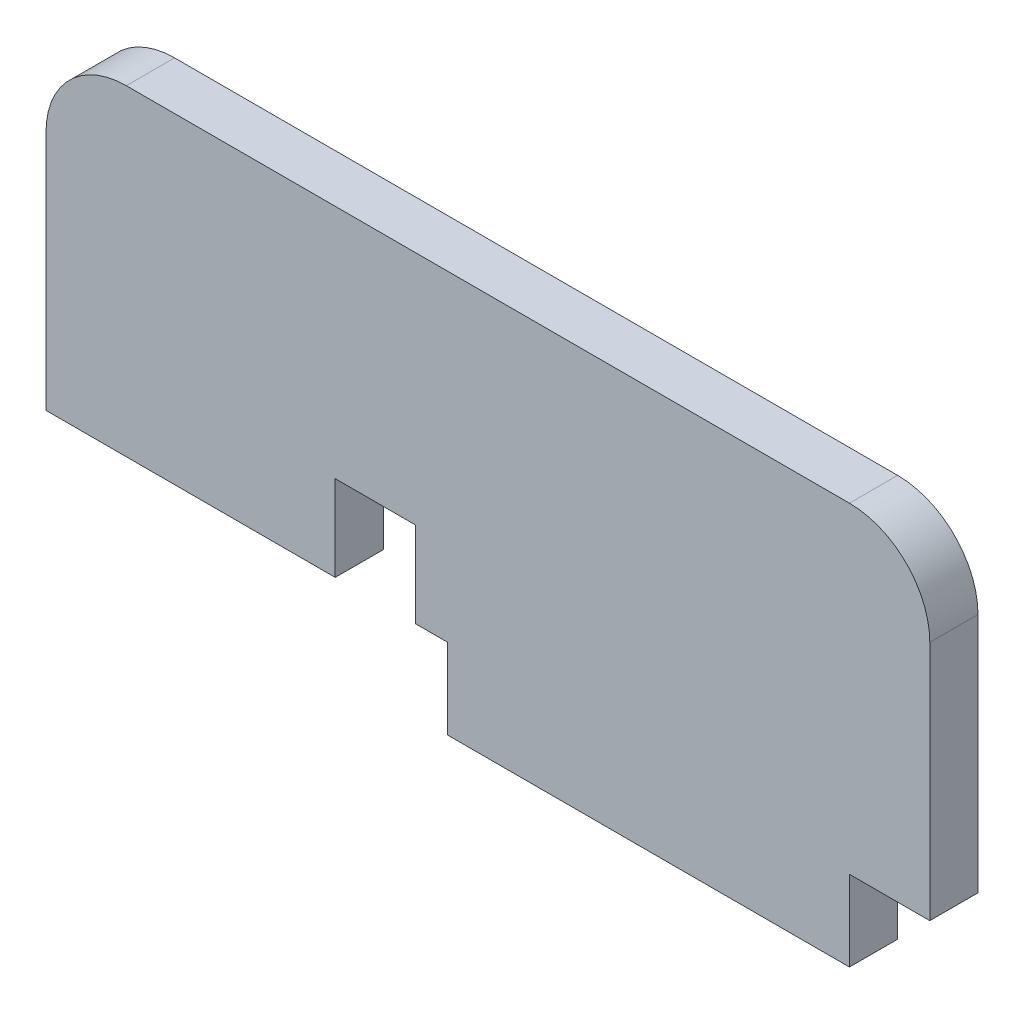
ISO-10303-21;
HEADER;
FILE_DESCRIPTION(('STEP AP214'),'2;1');
FILE_NAME('part.step','',(''),(''),'','','');
FILE_SCHEMA(('AUTOMOTIVE_DESIGN { 1 0 10303 214 1 1 1 1 }'));
ENDSEC;
DATA;
#1=APPLICATION_CONTEXT('core data for automotive mechanical design processes');
#2=APPLICATION_PROTOCOL_DEFINITION('international standard','automotive_design',2000,#1);
#3=PRODUCT_CONTEXT('',#1,'mechanical');
#4=PRODUCT('Part','Part','',(#3));
#5=PRODUCT_RELATED_PRODUCT_CATEGORY('part','',(#4));
#6=PRODUCT_DEFINITION_FORMATION('','',#4);
#7=PRODUCT_DEFINITION_CONTEXT('part definition',#1,'design');
#8=PRODUCT_DEFINITION('design','',#6,#7);
#9=PRODUCT_DEFINITION_SHAPE('','',#8);
#10=(LENGTH_UNIT() NAMED_UNIT(*) SI_UNIT(.MILLI.,.METRE.));
#11=(NAMED_UNIT(*) PLANE_ANGLE_UNIT() SI_UNIT($,.RADIAN.));
#12=(NAMED_UNIT(*) SI_UNIT($,.STERADIAN.) SOLID_ANGLE_UNIT());
#13=UNCERTAINTY_MEASURE_WITH_UNIT(LENGTH_MEASURE(1.E-05),#10,'distance_accuracy_value','');
#14=(GEOMETRIC_REPRESENTATION_CONTEXT(3) GLOBAL_UNCERTAINTY_ASSIGNED_CONTEXT((#13)) GLOBAL_UNIT_ASSIGNED_CONTEXT((#10,
#11,#12)) REPRESENTATION_CONTEXT('',''));
#15=CARTESIAN_POINT('',(0.,0.,0.));
#16=DIRECTION('',(0.,0.,1.));
#17=DIRECTION('',(1.,0.,0.));
#18=AXIS2_PLACEMENT_3D('',#15,#16,#17);
#19=CARTESIAN_POINT('',(-57.9411801297946,1.36975681721755,3.));
#20=DIRECTION('',(0.,1.,0.));
#21=DIRECTION('',(0.,0.,1.));
#22=AXIS2_PLACEMENT_3D('',#19,#20,#21);
#23=PLANE('',#22);
#24=DIRECTION('',(1.,0.,0.));
#25=VECTOR('',#24,1.);
#26=CARTESIAN_POINT('',(-57.9411801297946,1.36975681721755,0.));
#27=LINE('',#26,#25);
#28=CARTESIAN_POINT('',(-57.9411801297946,1.36975681721755,0.));
#29=VERTEX_POINT('',#28);
#30=CARTESIAN_POINT('',(-39.9411801297946,1.36975681721755,0.));
#31=VERTEX_POINT('',#30);
#32=EDGE_CURVE('E168',#29,#31,#27,.T.);
#33=ORIENTED_EDGE('',*,*,#32,.T.);
#34=DIRECTION('',(0.,0.,1.));
#35=VECTOR('',#34,1.);
#36=CARTESIAN_POINT('',(-39.9411801297946,1.36975681721755,0.));
#37=LINE('',#36,#35);
#38=CARTESIAN_POINT('',(-39.9411801297946,1.36975681721755,3.));
#39=VERTEX_POINT('',#38);
#40=EDGE_CURVE('E232',#31,#39,#37,.T.);
#41=ORIENTED_EDGE('',*,*,#40,.T.);
#42=DIRECTION('',(1.,0.,0.));
#43=VECTOR('',#42,1.);
#44=CARTESIAN_POINT('',(-57.9411801297946,1.36975681721755,3.));
#45=LINE('',#44,#43);
#46=CARTESIAN_POINT('',(-57.9411801297946,1.36975681721755,3.));
#47=VERTEX_POINT('',#46);
#48=EDGE_CURVE('E219',#47,#39,#45,.T.);
#49=ORIENTED_EDGE('',*,*,#48,.F.);
#50=DIRECTION('',(0.,0.,-1.));
#51=VECTOR('',#50,1.);
#52=CARTESIAN_POINT('',(-57.9411801297946,1.36975681721755,3.));
#53=LINE('',#52,#51);
#54=EDGE_CURVE('E184',#47,#29,#53,.T.);
#55=ORIENTED_EDGE('',*,*,#54,.T.);
#56=EDGE_LOOP('',(#33,#41,#49,#55));
#57=FACE_BOUND('',#56,.T.);
#58=ADVANCED_FACE('F33',(#57),#23,.F.);
#59=CARTESIAN_POINT('',(-2.94118012979462,16.3697568172175,3.));
#60=DIRECTION('',(-1.,0.,0.));
#61=DIRECTION('',(0.,-1.,0.));
#62=AXIS2_PLACEMENT_3D('',#59,#60,#61);
#63=PLANE('',#62);
#64=DIRECTION('',(0.,1.,0.));
#65=VECTOR('',#64,1.);
#66=CARTESIAN_POINT('',(-2.94118012979462,16.3697568172175,0.));
#67=LINE('',#66,#65);
#68=CARTESIAN_POINT('',(-2.94118012979462,1.36975681721755,0.));
#69=VERTEX_POINT('',#68);
#70=CARTESIAN_POINT('',(-2.94118012979461,16.3697568172175,0.));
#71=VERTEX_POINT('',#70);
#72=EDGE_CURVE('E155',#69,#71,#67,.T.);
#73=ORIENTED_EDGE('',*,*,#72,.T.);
#74=DIRECTION('',(0.,0.,-1.));
#75=VECTOR('',#74,1.);
#76=CARTESIAN_POINT('',(-2.94118012979461,16.3697568172175,3.));
#77=LINE('',#76,#75);
#78=CARTESIAN_POINT('',(-2.94118012979461,16.3697568172175,3.));
#79=VERTEX_POINT('',#78);
#80=EDGE_CURVE('E11',#79,#71,#77,.T.);
#81=ORIENTED_EDGE('',*,*,#80,.F.);
#82=DIRECTION('',(0.,1.,0.));
#83=VECTOR('',#82,1.);
#84=CARTESIAN_POINT('',(-2.94118012979462,16.3697568172175,3.));
#85=LINE('',#84,#83);
#86=CARTESIAN_POINT('',(-2.94118012979462,1.36975681721755,3.));
#87=VERTEX_POINT('',#86);
#88=EDGE_CURVE('E177',#87,#79,#85,.T.);
#89=ORIENTED_EDGE('',*,*,#88,.F.);
#90=DIRECTION('',(0.,0.,-1.));
#91=VECTOR('',#90,1.);
#92=CARTESIAN_POINT('',(-2.94118012979462,1.36975681721755,3.));
#93=LINE('',#92,#91);
#94=EDGE_CURVE('E151',#87,#69,#93,.T.);
#95=ORIENTED_EDGE('',*,*,#94,.T.);
#96=EDGE_LOOP('',(#73,#81,#89,#95));
#97=FACE_BOUND('',#96,.T.);
#98=ADVANCED_FACE('F35',(#97),#63,.F.);
#99=CARTESIAN_POINT('',(-7.94118012979462,16.3697568172176,3.));
#100=DIRECTION('',(0.,0.,-1.));
#101=DIRECTION('',(-1.,0.,0.));
#102=AXIS2_PLACEMENT_3D('',#99,#100,#101);
#103=CYLINDRICAL_SURFACE('',#102,5.);
#104=CARTESIAN_POINT('',(-7.94118012979462,16.3697568172176,0.));
#105=DIRECTION('',(0.,0.,1.));
#106=DIRECTION('',(-1.,0.,0.));
#107=AXIS2_PLACEMENT_3D('',#104,#105,#106);
#108=CIRCLE('',#107,5.);
#109=CARTESIAN_POINT('',(-7.94118012979465,21.3697568172176,0.));
#110=VERTEX_POINT('',#109);
#111=EDGE_CURVE('E158',#71,#110,#108,.T.);
#112=ORIENTED_EDGE('',*,*,#111,.T.);
#113=DIRECTION('',(0.,0.,-1.));
#114=VECTOR('',#113,1.);
#115=CARTESIAN_POINT('',(-7.94118012979465,21.3697568172176,3.));
#116=LINE('',#115,#114);
#117=CARTESIAN_POINT('',(-7.94118012979465,21.3697568172176,3.));
#118=VERTEX_POINT('',#117);
#119=EDGE_CURVE('E41',#118,#110,#116,.T.);
#120=ORIENTED_EDGE('',*,*,#119,.F.);
#121=CARTESIAN_POINT('',(-7.94118012979462,16.3697568172176,3.));
#122=DIRECTION('',(0.,0.,1.));
#123=DIRECTION('',(-1.,0.,0.));
#124=AXIS2_PLACEMENT_3D('',#121,#122,#123);
#125=CIRCLE('',#124,5.);
#126=EDGE_CURVE('E104',#79,#118,#125,.T.);
#127=ORIENTED_EDGE('',*,*,#126,.F.);
#128=ORIENTED_EDGE('',*,*,#80,.T.);
#129=EDGE_LOOP('',(#112,#120,#127,#128));
#130=FACE_BOUND('',#129,.T.);
#131=ADVANCED_FACE('F250',(#130),#103,.T.);
#132=CARTESIAN_POINT('',(-52.9411801297946,21.3697568172176,3.));
#133=DIRECTION('',(0.,-1.,0.));
#134=DIRECTION('',(0.,0.,-1.));
#135=AXIS2_PLACEMENT_3D('',#132,#133,#134);
#136=PLANE('',#135);
#137=DIRECTION('',(-1.,0.,0.));
#138=VECTOR('',#137,1.);
#139=CARTESIAN_POINT('',(-52.9411801297946,21.3697568172176,0.));
#140=LINE('',#139,#138);
#141=CARTESIAN_POINT('',(-52.9411801297946,21.3697568172176,0.));
#142=VERTEX_POINT('',#141);
#143=EDGE_CURVE('E161',#110,#142,#140,.T.);
#144=ORIENTED_EDGE('',*,*,#143,.T.);
#145=DIRECTION('',(0.,0.,-1.));
#146=VECTOR('',#145,1.);
#147=CARTESIAN_POINT('',(-52.9411801297946,21.3697568172176,3.));
#148=LINE('',#147,#146);
#149=CARTESIAN_POINT('',(-52.9411801297946,21.3697568172176,3.));
#150=VERTEX_POINT('',#149);
#151=EDGE_CURVE('E190',#150,#142,#148,.T.);
#152=ORIENTED_EDGE('',*,*,#151,.F.);
#153=DIRECTION('',(-1.,0.,0.));
#154=VECTOR('',#153,1.);
#155=CARTESIAN_POINT('',(-52.9411801297946,21.3697568172176,3.));
#156=LINE('',#155,#154);
#157=EDGE_CURVE('E198',#118,#150,#156,.T.);
#158=ORIENTED_EDGE('',*,*,#157,.F.);
#159=ORIENTED_EDGE('',*,*,#119,.T.);
#160=EDGE_LOOP('',(#144,#152,#158,#159));
#161=FACE_BOUND('',#160,.T.);
#162=ADVANCED_FACE('F196',(#161),#136,.F.);
#163=CARTESIAN_POINT('',(-52.9411801297946,16.3697568172176,3.));
#164=DIRECTION('',(0.,0.,-1.));
#165=DIRECTION('',(-1.,0.,0.));
#166=AXIS2_PLACEMENT_3D('',#163,#164,#165);
#167=CYLINDRICAL_SURFACE('',#166,5.);
#168=CARTESIAN_POINT('',(-52.9411801297946,16.3697568172176,0.));
#169=DIRECTION('',(0.,0.,1.));
#170=DIRECTION('',(1.,0.,0.));
#171=AXIS2_PLACEMENT_3D('',#168,#169,#170);
#172=CIRCLE('',#171,5.);
#173=CARTESIAN_POINT('',(-57.9411801297946,16.3697568172175,0.));
#174=VERTEX_POINT('',#173);
#175=EDGE_CURVE('E163',#142,#174,#172,.T.);
#176=ORIENTED_EDGE('',*,*,#175,.T.);
#177=DIRECTION('',(0.,0.,-1.));
#178=VECTOR('',#177,1.);
#179=CARTESIAN_POINT('',(-57.9411801297946,16.3697568172175,3.));
#180=LINE('',#179,#178);
#181=CARTESIAN_POINT('',(-57.9411801297946,16.3697568172175,3.));
#182=VERTEX_POINT('',#181);
#183=EDGE_CURVE('E187',#182,#174,#180,.T.);
#184=ORIENTED_EDGE('',*,*,#183,.F.);
#185=CARTESIAN_POINT('',(-52.9411801297946,16.3697568172176,3.));
#186=DIRECTION('',(0.,0.,1.));
#187=DIRECTION('',(1.,0.,0.));
#188=AXIS2_PLACEMENT_3D('',#185,#186,#187);
#189=CIRCLE('',#188,5.);
#190=EDGE_CURVE('E217',#150,#182,#189,.T.);
#191=ORIENTED_EDGE('',*,*,#190,.F.);
#192=ORIENTED_EDGE('',*,*,#151,.T.);
#193=EDGE_LOOP('',(#176,#184,#191,#192));
#194=FACE_BOUND('',#193,.T.);
#195=ADVANCED_FACE('F207',(#194),#167,.T.);
#196=CARTESIAN_POINT('',(-57.9411801297946,16.3697568172175,3.));
#197=DIRECTION('',(1.,0.,0.));
#198=DIRECTION('',(0.,0.,-1.));
#199=AXIS2_PLACEMENT_3D('',#196,#197,#198);
#200=PLANE('',#199);
#201=DIRECTION('',(0.,-1.,0.));
#202=VECTOR('',#201,1.);
#203=CARTESIAN_POINT('',(-57.9411801297946,16.3697568172175,0.));
#204=LINE('',#203,#202);
#205=EDGE_CURVE('E165',#174,#29,#204,.T.);
#206=ORIENTED_EDGE('',*,*,#205,.T.);
#207=ORIENTED_EDGE('',*,*,#54,.F.);
#208=DIRECTION('',(0.,-1.,0.));
#209=VECTOR('',#208,1.);
#210=CARTESIAN_POINT('',(-57.9411801297946,16.3697568172175,3.));
#211=LINE('',#210,#209);
#212=EDGE_CURVE('E213',#182,#47,#211,.T.);
#213=ORIENTED_EDGE('',*,*,#212,.F.);
#214=ORIENTED_EDGE('',*,*,#183,.T.);
#215=EDGE_LOOP('',(#206,#207,#213,#214));
#216=FACE_BOUND('',#215,.T.);
#217=ADVANCED_FACE('F211',(#216),#200,.F.);
#218=CARTESIAN_POINT('',(-34.9411801297946,1.36975681721755,3.));
#219=VERTEX_POINT('',#218);
#220=CARTESIAN_POINT('',(-32.9411801297946,1.36975681721755,3.));
#221=VERTEX_POINT('',#220);
#222=EDGE_CURVE('E216',#219,#221,#45,.T.);
#223=ORIENTED_EDGE('',*,*,#222,.F.);
#224=DIRECTION('',(0.,0.,1.));
#225=VECTOR('',#224,1.);
#226=CARTESIAN_POINT('',(-34.9411801297946,1.36975681721755,0.));
#227=LINE('',#226,#225);
#228=CARTESIAN_POINT('',(-34.9411801297946,1.36975681721755,0.));
#229=VERTEX_POINT('',#228);
#230=EDGE_CURVE('E237',#229,#219,#227,.T.);
#231=ORIENTED_EDGE('',*,*,#230,.F.);
#232=CARTESIAN_POINT('',(-32.9411801297946,1.36975681721755,0.));
#233=VERTEX_POINT('',#232);
#234=EDGE_CURVE('E167',#229,#233,#27,.T.);
#235=ORIENTED_EDGE('',*,*,#234,.T.);
#236=DIRECTION('',(0.,0.,-1.));
#237=VECTOR('',#236,1.);
#238=CARTESIAN_POINT('',(-32.9411801297946,1.36975681721755,3.));
#239=LINE('',#238,#237);
#240=EDGE_CURVE('E181',#221,#233,#239,.T.);
#241=ORIENTED_EDGE('',*,*,#240,.F.);
#242=EDGE_LOOP('',(#223,#231,#235,#241));
#243=FACE_BOUND('',#242,.T.);
#244=ADVANCED_FACE('F259',(#243),#23,.F.);
#245=CARTESIAN_POINT('',(-32.9411801297946,1.36975681721755,3.));
#246=DIRECTION('',(1.,0.,0.));
#247=DIRECTION('',(0.,0.,-1.));
#248=AXIS2_PLACEMENT_3D('',#245,#246,#247);
#249=PLANE('',#248);
#250=DIRECTION('',(0.,-1.,0.));
#251=VECTOR('',#250,1.);
#252=CARTESIAN_POINT('',(-32.9411801297946,1.36975681721755,0.));
#253=LINE('',#252,#251);
#254=CARTESIAN_POINT('',(-32.9411801297946,-3.63024318278245,0.));
#255=VERTEX_POINT('',#254);
#256=EDGE_CURVE('E171',#233,#255,#253,.T.);
#257=ORIENTED_EDGE('',*,*,#256,.T.);
#258=DIRECTION('',(0.,0.,-1.));
#259=VECTOR('',#258,1.);
#260=CARTESIAN_POINT('',(-32.9411801297946,-3.63024318278245,3.));
#261=LINE('',#260,#259);
#262=CARTESIAN_POINT('',(-32.9411801297946,-3.63024318278245,3.));
#263=VERTEX_POINT('',#262);
#264=EDGE_CURVE('E146',#263,#255,#261,.T.);
#265=ORIENTED_EDGE('',*,*,#264,.F.);
#266=DIRECTION('',(0.,-1.,0.));
#267=VECTOR('',#266,1.);
#268=CARTESIAN_POINT('',(-32.9411801297946,1.36975681721755,3.));
#269=LINE('',#268,#267);
#270=EDGE_CURVE('E134',#221,#263,#269,.T.);
#271=ORIENTED_EDGE('',*,*,#270,.F.);
#272=ORIENTED_EDGE('',*,*,#240,.T.);
#273=EDGE_LOOP('',(#257,#265,#271,#272));
#274=FACE_BOUND('',#273,.T.);
#275=ADVANCED_FACE('F265',(#274),#249,.F.);
#276=CARTESIAN_POINT('',(-32.9411801297946,-3.63024318278245,3.));
#277=DIRECTION('',(0.,1.,0.));
#278=DIRECTION('',(0.,0.,1.));
#279=AXIS2_PLACEMENT_3D('',#276,#277,#278);
#280=PLANE('',#279);
#281=DIRECTION('',(1.,0.,0.));
#282=VECTOR('',#281,1.);
#283=CARTESIAN_POINT('',(-32.9411801297946,-3.63024318278245,0.));
#284=LINE('',#283,#282);
#285=CARTESIAN_POINT('',(-7.94118012979461,-3.63024318278245,0.));
#286=VERTEX_POINT('',#285);
#287=EDGE_CURVE('E143',#255,#286,#284,.T.);
#288=ORIENTED_EDGE('',*,*,#287,.T.);
#289=DIRECTION('',(0.,0.,-1.));
#290=VECTOR('',#289,1.);
#291=CARTESIAN_POINT('',(-7.94118012979461,-3.63024318278245,3.));
#292=LINE('',#291,#290);
#293=CARTESIAN_POINT('',(-7.94118012979461,-3.63024318278245,3.));
#294=VERTEX_POINT('',#293);
#295=EDGE_CURVE('E140',#294,#286,#292,.T.);
#296=ORIENTED_EDGE('',*,*,#295,.F.);
#297=DIRECTION('',(1.,0.,0.));
#298=VECTOR('',#297,1.);
#299=CARTESIAN_POINT('',(-32.9411801297946,-3.63024318278245,3.));
#300=LINE('',#299,#298);
#301=EDGE_CURVE('E126',#263,#294,#300,.T.);
#302=ORIENTED_EDGE('',*,*,#301,.F.);
#303=ORIENTED_EDGE('',*,*,#264,.T.);
#304=EDGE_LOOP('',(#288,#296,#302,#303));
#305=FACE_BOUND('',#304,.T.);
#306=ADVANCED_FACE('F141',(#305),#280,.F.);
#307=CARTESIAN_POINT('',(-7.94118012979461,1.36975681721755,3.));
#308=DIRECTION('',(-1.,0.,0.));
#309=DIRECTION('',(0.,0.,1.));
#310=AXIS2_PLACEMENT_3D('',#307,#308,#309);
#311=PLANE('',#310);
#312=DIRECTION('',(0.,1.,0.));
#313=VECTOR('',#312,1.);
#314=CARTESIAN_POINT('',(-7.94118012979461,1.36975681721755,0.));
#315=LINE('',#314,#313);
#316=CARTESIAN_POINT('',(-7.94118012979461,1.36975681721755,0.));
#317=VERTEX_POINT('',#316);
#318=EDGE_CURVE('E174',#286,#317,#315,.T.);
#319=ORIENTED_EDGE('',*,*,#318,.T.);
#320=DIRECTION('',(0.,0.,-1.));
#321=VECTOR('',#320,1.);
#322=CARTESIAN_POINT('',(-7.94118012979461,1.36975681721755,3.));
#323=LINE('',#322,#321);
#324=CARTESIAN_POINT('',(-7.94118012979461,1.36975681721755,3.));
#325=VERTEX_POINT('',#324);
#326=EDGE_CURVE('E147',#325,#317,#323,.T.);
#327=ORIENTED_EDGE('',*,*,#326,.F.);
#328=DIRECTION('',(0.,1.,0.));
#329=VECTOR('',#328,1.);
#330=CARTESIAN_POINT('',(-7.94118012979461,1.36975681721755,3.));
#331=LINE('',#330,#329);
#332=EDGE_CURVE('E131',#294,#325,#331,.T.);
#333=ORIENTED_EDGE('',*,*,#332,.F.);
#334=ORIENTED_EDGE('',*,*,#295,.T.);
#335=EDGE_LOOP('',(#319,#327,#333,#334));
#336=FACE_BOUND('',#335,.T.);
#337=ADVANCED_FACE('F149',(#336),#311,.F.);
#338=CARTESIAN_POINT('',(-7.94118012979461,1.36975681721755,3.));
#339=DIRECTION('',(0.,1.,0.));
#340=DIRECTION('',(-1.,0.,0.));
#341=AXIS2_PLACEMENT_3D('',#338,#339,#340);
#342=PLANE('',#341);
#343=DIRECTION('',(1.,0.,0.));
#344=VECTOR('',#343,1.);
#345=CARTESIAN_POINT('',(-7.94118012979461,1.36975681721755,0.));
#346=LINE('',#345,#344);
#347=EDGE_CURVE('E96',#317,#69,#346,.T.);
#348=ORIENTED_EDGE('',*,*,#347,.T.);
#349=ORIENTED_EDGE('',*,*,#94,.F.);
#350=DIRECTION('',(1.,0.,0.));
#351=VECTOR('',#350,1.);
#352=CARTESIAN_POINT('',(-7.94118012979461,1.36975681721755,3.));
#353=LINE('',#352,#351);
#354=EDGE_CURVE('E57',#325,#87,#353,.T.);
#355=ORIENTED_EDGE('',*,*,#354,.F.);
#356=ORIENTED_EDGE('',*,*,#326,.T.);
#357=EDGE_LOOP('',(#348,#349,#355,#356));
#358=FACE_BOUND('',#357,.T.);
#359=ADVANCED_FACE('F313',(#358),#342,.F.);
#360=CARTESIAN_POINT('',(-52.9411801297946,16.3697568172176,3.));
#361=DIRECTION('',(0.,0.,1.));
#362=DIRECTION('',(1.,0.,0.));
#363=AXIS2_PLACEMENT_3D('',#360,#361,#362);
#364=PLANE('',#363);
#365=DIRECTION('',(0.,-1.,0.));
#366=VECTOR('',#365,1.);
#367=CARTESIAN_POINT('',(-39.9411801297946,1.36975681721755,3.));
#368=LINE('',#367,#366);
#369=CARTESIAN_POINT('',(-39.9411801297946,6.69190676151743,3.));
#370=VERTEX_POINT('',#369);
#371=EDGE_CURVE('E226',#370,#39,#368,.T.);
#372=ORIENTED_EDGE('',*,*,#371,.F.);
#373=DIRECTION('',(-1.,0.,0.));
#374=VECTOR('',#373,1.);
#375=CARTESIAN_POINT('',(-39.9411801297946,6.69190676151743,3.));
#376=LINE('',#375,#374);
#377=CARTESIAN_POINT('',(-34.9411801297946,6.69190676151743,3.));
#378=VERTEX_POINT('',#377);
#379=EDGE_CURVE('E283',#378,#370,#376,.T.);
#380=ORIENTED_EDGE('',*,*,#379,.F.);
#381=DIRECTION('',(0.,1.,0.));
#382=VECTOR('',#381,1.);
#383=CARTESIAN_POINT('',(-34.9411801297946,1.36975681721755,3.));
#384=LINE('',#383,#382);
#385=EDGE_CURVE('E281',#219,#378,#384,.T.);
#386=ORIENTED_EDGE('',*,*,#385,.F.);
#387=ORIENTED_EDGE('',*,*,#222,.T.);
#388=ORIENTED_EDGE('',*,*,#270,.T.);
#389=ORIENTED_EDGE('',*,*,#301,.T.);
#390=ORIENTED_EDGE('',*,*,#332,.T.);
#391=ORIENTED_EDGE('',*,*,#354,.T.);
#392=ORIENTED_EDGE('',*,*,#88,.T.);
#393=ORIENTED_EDGE('',*,*,#126,.T.);
#394=ORIENTED_EDGE('',*,*,#157,.T.);
#395=ORIENTED_EDGE('',*,*,#190,.T.);
#396=ORIENTED_EDGE('',*,*,#212,.T.);
#397=ORIENTED_EDGE('',*,*,#48,.T.);
#398=EDGE_LOOP('',(#372,#380,#386,#387,#388,#389,#390,#391,#392,#393,#394,#395,#396,#397));
#399=FACE_BOUND('',#398,.T.);
#400=ADVANCED_FACE('F129',(#399),#364,.T.);
#401=CARTESIAN_POINT('',(-52.9411801297946,16.3697568172176,0.));
#402=DIRECTION('',(0.,0.,1.));
#403=DIRECTION('',(1.,0.,0.));
#404=AXIS2_PLACEMENT_3D('',#401,#402,#403);
#405=PLANE('',#404);
#406=DIRECTION('',(-1.,0.,0.));
#407=VECTOR('',#406,1.);
#408=CARTESIAN_POINT('',(-39.9411801297946,6.69190676151743,0.));
#409=LINE('',#408,#407);
#410=CARTESIAN_POINT('',(-34.9411801297946,6.69190676151743,0.));
#411=VERTEX_POINT('',#410);
#412=CARTESIAN_POINT('',(-39.9411801297946,6.69190676151743,0.));
#413=VERTEX_POINT('',#412);
#414=EDGE_CURVE('E48',#411,#413,#409,.T.);
#415=ORIENTED_EDGE('',*,*,#414,.T.);
#416=DIRECTION('',(0.,-1.,0.));
#417=VECTOR('',#416,1.);
#418=CARTESIAN_POINT('',(-39.9411801297946,1.36975681721755,0.));
#419=LINE('',#418,#417);
#420=EDGE_CURVE('E286',#413,#31,#419,.T.);
#421=ORIENTED_EDGE('',*,*,#420,.T.);
#422=ORIENTED_EDGE('',*,*,#32,.F.);
#423=ORIENTED_EDGE('',*,*,#205,.F.);
#424=ORIENTED_EDGE('',*,*,#175,.F.);
#425=ORIENTED_EDGE('',*,*,#143,.F.);
#426=ORIENTED_EDGE('',*,*,#111,.F.);
#427=ORIENTED_EDGE('',*,*,#72,.F.);
#428=ORIENTED_EDGE('',*,*,#347,.F.);
#429=ORIENTED_EDGE('',*,*,#318,.F.);
#430=ORIENTED_EDGE('',*,*,#287,.F.);
#431=ORIENTED_EDGE('',*,*,#256,.F.);
#432=ORIENTED_EDGE('',*,*,#234,.F.);
#433=DIRECTION('',(0.,1.,0.));
#434=VECTOR('',#433,1.);
#435=CARTESIAN_POINT('',(-34.9411801297946,1.36975681721755,0.));
#436=LINE('',#435,#434);
#437=EDGE_CURVE('E242',#229,#411,#436,.T.);
#438=ORIENTED_EDGE('',*,*,#437,.T.);
#439=EDGE_LOOP('',(#415,#421,#422,#423,#424,#425,#426,#427,#428,#429,#430,#431,#432,#438));
#440=FACE_BOUND('',#439,.T.);
#441=ADVANCED_FACE('F201',(#440),#405,.F.);
#442=CARTESIAN_POINT('',(-39.9411801297946,1.36975681721755,0.));
#443=DIRECTION('',(-1.,0.,0.));
#444=DIRECTION('',(0.,0.,1.));
#445=AXIS2_PLACEMENT_3D('',#442,#443,#444);
#446=PLANE('',#445);
#447=ORIENTED_EDGE('',*,*,#371,.T.);
#448=ORIENTED_EDGE('',*,*,#40,.F.);
#449=ORIENTED_EDGE('',*,*,#420,.F.);
#450=DIRECTION('',(0.,0.,1.));
#451=VECTOR('',#450,1.);
#452=CARTESIAN_POINT('',(-39.9411801297946,6.69190676151743,0.));
#453=LINE('',#452,#451);
#454=EDGE_CURVE('E159',#413,#370,#453,.T.);
#455=ORIENTED_EDGE('',*,*,#454,.T.);
#456=EDGE_LOOP('',(#447,#448,#449,#455));
#457=FACE_BOUND('',#456,.T.);
#458=ADVANCED_FACE('F299',(#457),#446,.F.);
#459=CARTESIAN_POINT('',(-39.9411801297946,6.69190676151743,0.));
#460=DIRECTION('',(0.,1.,0.));
#461=DIRECTION('',(0.,0.,1.));
#462=AXIS2_PLACEMENT_3D('',#459,#460,#461);
#463=PLANE('',#462);
#464=ORIENTED_EDGE('',*,*,#379,.T.);
#465=ORIENTED_EDGE('',*,*,#454,.F.);
#466=ORIENTED_EDGE('',*,*,#414,.F.);
#467=DIRECTION('',(0.,0.,1.));
#468=VECTOR('',#467,1.);
#469=CARTESIAN_POINT('',(-34.9411801297946,6.69190676151743,0.));
#470=LINE('',#469,#468);
#471=EDGE_CURVE('E240',#411,#378,#470,.T.);
#472=ORIENTED_EDGE('',*,*,#471,.T.);
#473=EDGE_LOOP('',(#464,#465,#466,#472));
#474=FACE_BOUND('',#473,.T.);
#475=ADVANCED_FACE('F291',(#474),#463,.F.);
#476=CARTESIAN_POINT('',(-34.9411801297946,1.36975681721755,0.));
#477=DIRECTION('',(1.,0.,0.));
#478=DIRECTION('',(0.,0.,-1.));
#479=AXIS2_PLACEMENT_3D('',#476,#477,#478);
#480=PLANE('',#479);
#481=ORIENTED_EDGE('',*,*,#385,.T.);
#482=ORIENTED_EDGE('',*,*,#471,.F.);
#483=ORIENTED_EDGE('',*,*,#437,.F.);
#484=ORIENTED_EDGE('',*,*,#230,.T.);
#485=EDGE_LOOP('',(#481,#482,#483,#484));
#486=FACE_BOUND('',#485,.T.);
#487=ADVANCED_FACE('F294',(#486),#480,.F.);
#488=CLOSED_SHELL('',(#58,#98,#131,#162,#195,#217,#244,#275,#306,#337,#359,#400,#441,#458,#475,#487));
#489=MANIFOLD_SOLID_BREP('B2',#488);
#490=ADVANCED_BREP_SHAPE_REPRESENTATION('',(#18,#489),#14);
#491=SHAPE_DEFINITION_REPRESENTATION(#9,#490);
ENDSEC;
END-ISO-10303-21;
